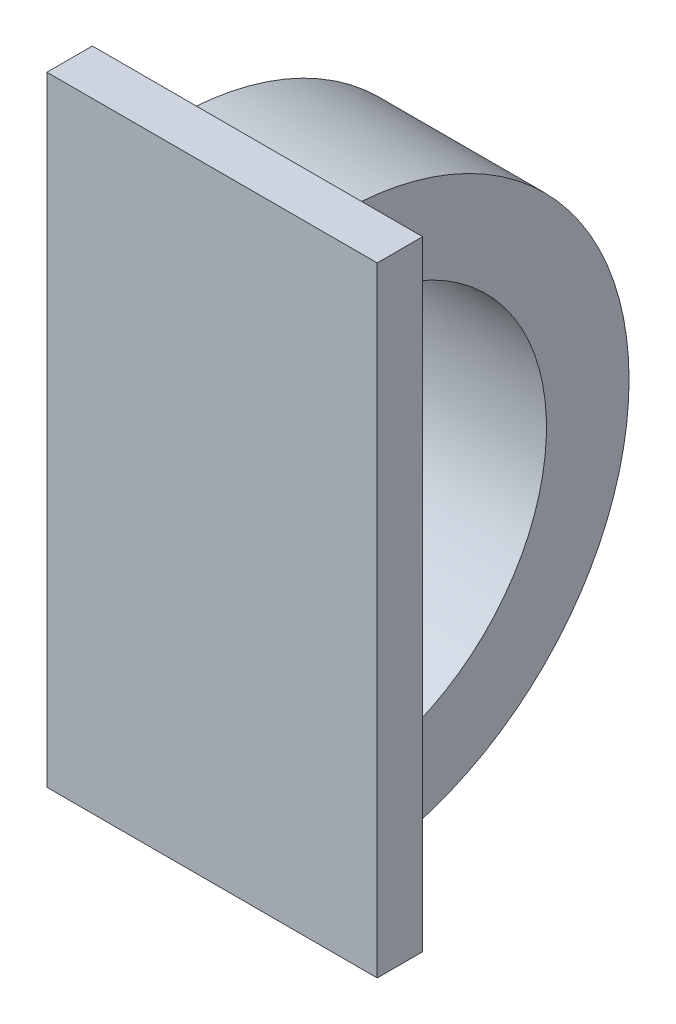
ISO-10303-21;
HEADER;
FILE_DESCRIPTION(('STEP AP214'),'2;1');
FILE_NAME('part.step','',(''),(''),'','','');
FILE_SCHEMA(('AUTOMOTIVE_DESIGN { 1 0 10303 214 1 1 1 1 }'));
ENDSEC;
DATA;
#1=APPLICATION_CONTEXT('core data for automotive mechanical design processes');
#2=APPLICATION_PROTOCOL_DEFINITION('international standard','automotive_design',2000,#1);
#3=PRODUCT_CONTEXT('',#1,'mechanical');
#4=PRODUCT('Part','Part','',(#3));
#5=PRODUCT_RELATED_PRODUCT_CATEGORY('part','',(#4));
#6=PRODUCT_DEFINITION_FORMATION('','',#4);
#7=PRODUCT_DEFINITION_CONTEXT('part definition',#1,'design');
#8=PRODUCT_DEFINITION('design','',#6,#7);
#9=PRODUCT_DEFINITION_SHAPE('','',#8);
#10=(LENGTH_UNIT() NAMED_UNIT(*) SI_UNIT(.MILLI.,.METRE.));
#11=(NAMED_UNIT(*) PLANE_ANGLE_UNIT() SI_UNIT($,.RADIAN.));
#12=(NAMED_UNIT(*) SI_UNIT($,.STERADIAN.) SOLID_ANGLE_UNIT());
#13=UNCERTAINTY_MEASURE_WITH_UNIT(LENGTH_MEASURE(1.E-05),#10,'distance_accuracy_value','');
#14=(GEOMETRIC_REPRESENTATION_CONTEXT(3) GLOBAL_UNCERTAINTY_ASSIGNED_CONTEXT((#13)) GLOBAL_UNIT_ASSIGNED_CONTEXT((#10,
#11,#12)) REPRESENTATION_CONTEXT('',''));
#15=CARTESIAN_POINT('',(0.,0.,0.));
#16=DIRECTION('',(0.,0.,1.));
#17=DIRECTION('',(1.,0.,0.));
#18=AXIS2_PLACEMENT_3D('',#15,#16,#17);
#19=CARTESIAN_POINT('',(4.,7.5,1.1));
#20=DIRECTION('',(-1.,0.,0.));
#21=DIRECTION('',(0.,-1.,0.));
#22=AXIS2_PLACEMENT_3D('',#19,#20,#21);
#23=PLANE('',#22);
#24=DIRECTION('',(0.,1.,0.));
#25=VECTOR('',#24,1.);
#26=CARTESIAN_POINT('',(4.,7.5,0.));
#27=LINE('',#26,#25);
#28=CARTESIAN_POINT('',(4.,-7.5,0.));
#29=VERTEX_POINT('',#28);
#30=CARTESIAN_POINT('',(4.,7.5,0.));
#31=VERTEX_POINT('',#30);
#32=EDGE_CURVE('E105',#29,#31,#27,.T.);
#33=ORIENTED_EDGE('',*,*,#32,.T.);
#34=DIRECTION('',(0.,0.,-1.));
#35=VECTOR('',#34,1.);
#36=CARTESIAN_POINT('',(4.,7.5,1.1));
#37=LINE('',#36,#35);
#38=CARTESIAN_POINT('',(4.,7.5,1.1));
#39=VERTEX_POINT('',#38);
#40=EDGE_CURVE('E11',#39,#31,#37,.T.);
#41=ORIENTED_EDGE('',*,*,#40,.F.);
#42=DIRECTION('',(0.,1.,0.));
#43=VECTOR('',#42,1.);
#44=CARTESIAN_POINT('',(4.,7.5,1.1));
#45=LINE('',#44,#43);
#46=CARTESIAN_POINT('',(4.,-7.5,1.1));
#47=VERTEX_POINT('',#46);
#48=EDGE_CURVE('E130',#47,#39,#45,.T.);
#49=ORIENTED_EDGE('',*,*,#48,.F.);
#50=DIRECTION('',(0.,0.,-1.));
#51=VECTOR('',#50,1.);
#52=CARTESIAN_POINT('',(4.,-7.5,1.1));
#53=LINE('',#52,#51);
#54=EDGE_CURVE('E140',#47,#29,#53,.T.);
#55=ORIENTED_EDGE('',*,*,#54,.T.);
#56=EDGE_LOOP('',(#33,#41,#49,#55));
#57=FACE_BOUND('',#56,.T.);
#58=ADVANCED_FACE('F32',(#57),#23,.F.);
#59=CARTESIAN_POINT('',(-4.,7.5,1.1));
#60=DIRECTION('',(0.,-1.,0.));
#61=DIRECTION('',(0.,0.,-1.));
#62=AXIS2_PLACEMENT_3D('',#59,#60,#61);
#63=PLANE('',#62);
#64=DIRECTION('',(-1.,0.,0.));
#65=VECTOR('',#64,1.);
#66=CARTESIAN_POINT('',(-4.,7.5,0.));
#67=LINE('',#66,#65);
#68=CARTESIAN_POINT('',(-4.,7.5,0.));
#69=VERTEX_POINT('',#68);
#70=EDGE_CURVE('E143',#31,#69,#67,.T.);
#71=ORIENTED_EDGE('',*,*,#70,.T.);
#72=DIRECTION('',(0.,0.,-1.));
#73=VECTOR('',#72,1.);
#74=CARTESIAN_POINT('',(-4.,7.5,1.1));
#75=LINE('',#74,#73);
#76=CARTESIAN_POINT('',(-4.,7.5,1.1));
#77=VERTEX_POINT('',#76);
#78=EDGE_CURVE('E39',#77,#69,#75,.T.);
#79=ORIENTED_EDGE('',*,*,#78,.F.);
#80=DIRECTION('',(-1.,0.,0.));
#81=VECTOR('',#80,1.);
#82=CARTESIAN_POINT('',(-4.,7.5,1.1));
#83=LINE('',#82,#81);
#84=EDGE_CURVE('E133',#39,#77,#83,.T.);
#85=ORIENTED_EDGE('',*,*,#84,.F.);
#86=ORIENTED_EDGE('',*,*,#40,.T.);
#87=EDGE_LOOP('',(#71,#79,#85,#86));
#88=FACE_BOUND('',#87,.T.);
#89=ADVANCED_FACE('F171',(#88),#63,.F.);
#90=CARTESIAN_POINT('',(-4.,7.5,1.1));
#91=DIRECTION('',(1.,0.,0.));
#92=DIRECTION('',(0.,1.,0.));
#93=AXIS2_PLACEMENT_3D('',#90,#91,#92);
#94=PLANE('',#93);
#95=DIRECTION('',(0.,-1.,0.));
#96=VECTOR('',#95,1.);
#97=CARTESIAN_POINT('',(-4.,7.5,0.));
#98=LINE('',#97,#96);
#99=CARTESIAN_POINT('',(-4.,-7.5,0.));
#100=VERTEX_POINT('',#99);
#101=EDGE_CURVE('E145',#69,#100,#98,.T.);
#102=ORIENTED_EDGE('',*,*,#101,.T.);
#103=DIRECTION('',(0.,0.,-1.));
#104=VECTOR('',#103,1.);
#105=CARTESIAN_POINT('',(-4.,-7.5,1.1));
#106=LINE('',#105,#104);
#107=CARTESIAN_POINT('',(-4.,-7.5,1.1));
#108=VERTEX_POINT('',#107);
#109=EDGE_CURVE('E150',#108,#100,#106,.T.);
#110=ORIENTED_EDGE('',*,*,#109,.F.);
#111=DIRECTION('',(0.,-1.,0.));
#112=VECTOR('',#111,1.);
#113=CARTESIAN_POINT('',(-4.,7.5,1.1));
#114=LINE('',#113,#112);
#115=EDGE_CURVE('E136',#77,#108,#114,.T.);
#116=ORIENTED_EDGE('',*,*,#115,.F.);
#117=ORIENTED_EDGE('',*,*,#78,.T.);
#118=EDGE_LOOP('',(#102,#110,#116,#117));
#119=FACE_BOUND('',#118,.T.);
#120=ADVANCED_FACE('F157',(#119),#94,.F.);
#121=CARTESIAN_POINT('',(-4.,-7.5,1.1));
#122=DIRECTION('',(0.,1.,0.));
#123=DIRECTION('',(0.,0.,1.));
#124=AXIS2_PLACEMENT_3D('',#121,#122,#123);
#125=PLANE('',#124);
#126=DIRECTION('',(1.,0.,0.));
#127=VECTOR('',#126,1.);
#128=CARTESIAN_POINT('',(-4.,-7.5,0.));
#129=LINE('',#128,#127);
#130=EDGE_CURVE('E134',#100,#29,#129,.T.);
#131=ORIENTED_EDGE('',*,*,#130,.T.);
#132=ORIENTED_EDGE('',*,*,#54,.F.);
#133=DIRECTION('',(1.,0.,0.));
#134=VECTOR('',#133,1.);
#135=CARTESIAN_POINT('',(-4.,-7.5,1.1));
#136=LINE('',#135,#134);
#137=EDGE_CURVE('E138',#108,#47,#136,.T.);
#138=ORIENTED_EDGE('',*,*,#137,.F.);
#139=ORIENTED_EDGE('',*,*,#109,.T.);
#140=EDGE_LOOP('',(#131,#132,#138,#139));
#141=FACE_BOUND('',#140,.T.);
#142=ADVANCED_FACE('F164',(#141),#125,.F.);
#143=CARTESIAN_POINT('',(0.,0.,1.1));
#144=DIRECTION('',(0.,0.,1.));
#145=DIRECTION('',(1.,0.,0.));
#146=AXIS2_PLACEMENT_3D('',#143,#144,#145);
#147=PLANE('',#146);
#148=ORIENTED_EDGE('',*,*,#48,.T.);
#149=ORIENTED_EDGE('',*,*,#84,.T.);
#150=ORIENTED_EDGE('',*,*,#115,.T.);
#151=ORIENTED_EDGE('',*,*,#137,.T.);
#152=EDGE_LOOP('',(#148,#149,#150,#151));
#153=FACE_BOUND('',#152,.T.);
#154=ADVANCED_FACE('F170',(#153),#147,.T.);
#155=CARTESIAN_POINT('',(0.,0.,0.));
#156=DIRECTION('',(0.,0.,1.));
#157=DIRECTION('',(1.,0.,0.));
#158=AXIS2_PLACEMENT_3D('',#155,#156,#157);
#159=PLANE('',#158);
#160=DIRECTION('',(-1.,0.,0.));
#161=VECTOR('',#160,1.);
#162=CARTESIAN_POINT('',(2.,-7.,0.));
#163=LINE('',#162,#161);
#164=CARTESIAN_POINT('',(2.,-7.,0.));
#165=VERTEX_POINT('',#164);
#166=CARTESIAN_POINT('',(-2.,-7.,0.));
#167=VERTEX_POINT('',#166);
#168=EDGE_CURVE('E46',#165,#167,#163,.T.);
#169=ORIENTED_EDGE('',*,*,#168,.F.);
#170=DIRECTION('',(0.,-1.,0.));
#171=VECTOR('',#170,1.);
#172=CARTESIAN_POINT('',(2.,-5.,0.));
#173=LINE('',#172,#171);
#174=CARTESIAN_POINT('',(2.,-5.,0.));
#175=VERTEX_POINT('',#174);
#176=EDGE_CURVE('E50',#175,#165,#173,.T.);
#177=ORIENTED_EDGE('',*,*,#176,.F.);
#178=DIRECTION('',(-1.,0.,0.));
#179=VECTOR('',#178,1.);
#180=CARTESIAN_POINT('',(2.,-5.,0.));
#181=LINE('',#180,#179);
#182=CARTESIAN_POINT('',(-2.,-5.,0.));
#183=VERTEX_POINT('',#182);
#184=EDGE_CURVE('E127',#175,#183,#181,.T.);
#185=ORIENTED_EDGE('',*,*,#184,.T.);
#186=DIRECTION('',(0.,-1.,0.));
#187=VECTOR('',#186,1.);
#188=CARTESIAN_POINT('',(-2.,-5.,0.));
#189=LINE('',#188,#187);
#190=EDGE_CURVE('E123',#183,#167,#189,.T.);
#191=ORIENTED_EDGE('',*,*,#190,.T.);
#192=EDGE_LOOP('',(#169,#177,#185,#191));
#193=FACE_BOUND('',#192,.T.);
#194=DIRECTION('',(-1.,0.,0.));
#195=VECTOR('',#194,1.);
#196=CARTESIAN_POINT('',(2.,5.,0.));
#197=LINE('',#196,#195);
#198=CARTESIAN_POINT('',(2.,5.,0.));
#199=VERTEX_POINT('',#198);
#200=CARTESIAN_POINT('',(-2.,5.,0.));
#201=VERTEX_POINT('',#200);
#202=EDGE_CURVE('E106',#199,#201,#197,.T.);
#203=ORIENTED_EDGE('',*,*,#202,.F.);
#204=DIRECTION('',(0.,-1.,0.));
#205=VECTOR('',#204,1.);
#206=CARTESIAN_POINT('',(2.,7.,0.));
#207=LINE('',#206,#205);
#208=CARTESIAN_POINT('',(2.,7.,0.));
#209=VERTEX_POINT('',#208);
#210=EDGE_CURVE('E100',#209,#199,#207,.T.);
#211=ORIENTED_EDGE('',*,*,#210,.F.);
#212=DIRECTION('',(-1.,0.,0.));
#213=VECTOR('',#212,1.);
#214=CARTESIAN_POINT('',(2.,7.,0.));
#215=LINE('',#214,#213);
#216=CARTESIAN_POINT('',(-2.,7.,0.));
#217=VERTEX_POINT('',#216);
#218=EDGE_CURVE('E93',#209,#217,#215,.T.);
#219=ORIENTED_EDGE('',*,*,#218,.T.);
#220=DIRECTION('',(0.,-1.,0.));
#221=VECTOR('',#220,1.);
#222=CARTESIAN_POINT('',(-2.,7.,0.));
#223=LINE('',#222,#221);
#224=EDGE_CURVE('E97',#217,#201,#223,.T.);
#225=ORIENTED_EDGE('',*,*,#224,.T.);
#226=EDGE_LOOP('',(#203,#211,#219,#225));
#227=FACE_BOUND('',#226,.T.);
#228=ORIENTED_EDGE('',*,*,#32,.F.);
#229=ORIENTED_EDGE('',*,*,#130,.F.);
#230=ORIENTED_EDGE('',*,*,#101,.F.);
#231=ORIENTED_EDGE('',*,*,#70,.F.);
#232=EDGE_LOOP('',(#228,#229,#230,#231));
#233=FACE_BOUND('',#232,.T.);
#234=ADVANCED_FACE('F95',(#193,#227,#233),#159,.F.);
#235=CARTESIAN_POINT('',(2.,0.,0.));
#236=DIRECTION('',(-1.,0.,0.));
#237=DIRECTION('',(0.,0.,1.));
#238=AXIS2_PLACEMENT_3D('',#235,#236,#237);
#239=CYLINDRICAL_SURFACE('',#238,7.);
#240=CARTESIAN_POINT('',(-2.,0.,0.));
#241=DIRECTION('',(1.,0.,0.));
#242=DIRECTION('',(0.,0.,-1.));
#243=AXIS2_PLACEMENT_3D('',#240,#241,#242);
#244=CIRCLE('',#243,7.);
#245=EDGE_CURVE('E113',#167,#217,#244,.T.);
#246=ORIENTED_EDGE('',*,*,#245,.T.);
#247=ORIENTED_EDGE('',*,*,#218,.F.);
#248=CARTESIAN_POINT('',(2.,0.,0.));
#249=DIRECTION('',(1.,0.,0.));
#250=DIRECTION('',(0.,0.,-1.));
#251=AXIS2_PLACEMENT_3D('',#248,#249,#250);
#252=CIRCLE('',#251,7.);
#253=EDGE_CURVE('E125',#165,#209,#252,.T.);
#254=ORIENTED_EDGE('',*,*,#253,.F.);
#255=ORIENTED_EDGE('',*,*,#168,.T.);
#256=EDGE_LOOP('',(#246,#247,#254,#255));
#257=FACE_BOUND('',#256,.T.);
#258=ADVANCED_FACE('F117',(#257),#239,.T.);
#259=CARTESIAN_POINT('',(2.,0.,0.));
#260=DIRECTION('',(-1.,0.,0.));
#261=DIRECTION('',(0.,0.,1.));
#262=AXIS2_PLACEMENT_3D('',#259,#260,#261);
#263=CYLINDRICAL_SURFACE('',#262,5.);
#264=CARTESIAN_POINT('',(-2.,0.,0.));
#265=DIRECTION('',(-1.,0.,0.));
#266=DIRECTION('',(0.,0.,-1.));
#267=AXIS2_PLACEMENT_3D('',#264,#265,#266);
#268=CIRCLE('',#267,5.);
#269=EDGE_CURVE('E115',#201,#183,#268,.T.);
#270=ORIENTED_EDGE('',*,*,#269,.T.);
#271=ORIENTED_EDGE('',*,*,#184,.F.);
#272=CARTESIAN_POINT('',(2.,0.,0.));
#273=DIRECTION('',(-1.,0.,0.));
#274=DIRECTION('',(0.,0.,-1.));
#275=AXIS2_PLACEMENT_3D('',#272,#273,#274);
#276=CIRCLE('',#275,5.);
#277=EDGE_CURVE('E200',#199,#175,#276,.T.);
#278=ORIENTED_EDGE('',*,*,#277,.F.);
#279=ORIENTED_EDGE('',*,*,#202,.T.);
#280=EDGE_LOOP('',(#270,#271,#278,#279));
#281=FACE_BOUND('',#280,.T.);
#282=ADVANCED_FACE('F187',(#281),#263,.F.);
#283=CARTESIAN_POINT('',(2.,0.,0.));
#284=DIRECTION('',(1.,0.,0.));
#285=DIRECTION('',(0.,0.,-1.));
#286=AXIS2_PLACEMENT_3D('',#283,#284,#285);
#287=PLANE('',#286);
#288=ORIENTED_EDGE('',*,*,#253,.T.);
#289=ORIENTED_EDGE('',*,*,#210,.T.);
#290=ORIENTED_EDGE('',*,*,#277,.T.);
#291=ORIENTED_EDGE('',*,*,#176,.T.);
#292=EDGE_LOOP('',(#288,#289,#290,#291));
#293=FACE_BOUND('',#292,.T.);
#294=ADVANCED_FACE('F190',(#293),#287,.T.);
#295=CARTESIAN_POINT('',(-2.,0.,0.));
#296=DIRECTION('',(1.,0.,0.));
#297=DIRECTION('',(0.,0.,-1.));
#298=AXIS2_PLACEMENT_3D('',#295,#296,#297);
#299=PLANE('',#298);
#300=ORIENTED_EDGE('',*,*,#245,.F.);
#301=ORIENTED_EDGE('',*,*,#190,.F.);
#302=ORIENTED_EDGE('',*,*,#269,.F.);
#303=ORIENTED_EDGE('',*,*,#224,.F.);
#304=EDGE_LOOP('',(#300,#301,#302,#303));
#305=FACE_BOUND('',#304,.T.);
#306=ADVANCED_FACE('F111',(#305),#299,.F.);
#307=CLOSED_SHELL('',(#58,#89,#120,#142,#154,#234,#258,#282,#294,#306));
#308=MANIFOLD_SOLID_BREP('B2',#307);
#309=ADVANCED_BREP_SHAPE_REPRESENTATION('',(#18,#308),#14);
#310=SHAPE_DEFINITION_REPRESENTATION(#9,#309);
ENDSEC;
END-ISO-10303-21;
